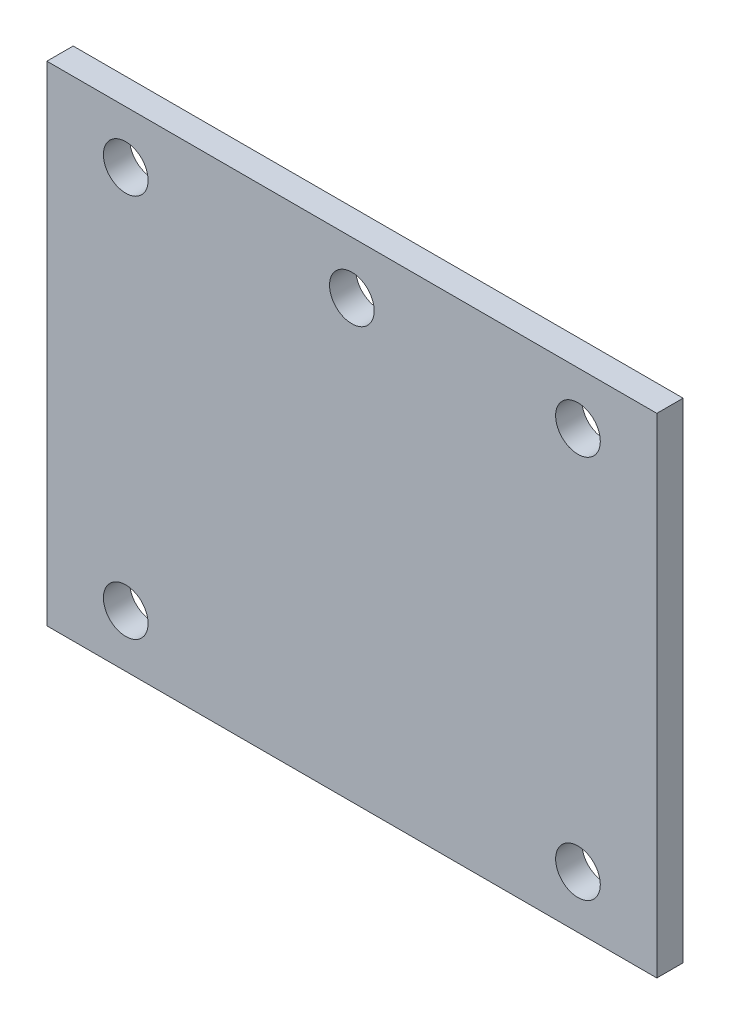
ISO-10303-21;
HEADER;
FILE_DESCRIPTION(('STEP AP214'),'2;1');
FILE_NAME('part.step','',(''),(''),'','','');
FILE_SCHEMA(('AUTOMOTIVE_DESIGN { 1 0 10303 214 1 1 1 1 }'));
ENDSEC;
DATA;
#1=APPLICATION_CONTEXT('core data for automotive mechanical design processes');
#2=APPLICATION_PROTOCOL_DEFINITION('international standard','automotive_design',2000,#1);
#3=PRODUCT_CONTEXT('',#1,'mechanical');
#4=PRODUCT('Part','Part','',(#3));
#5=PRODUCT_RELATED_PRODUCT_CATEGORY('part','',(#4));
#6=PRODUCT_DEFINITION_FORMATION('','',#4);
#7=PRODUCT_DEFINITION_CONTEXT('part definition',#1,'design');
#8=PRODUCT_DEFINITION('design','',#6,#7);
#9=PRODUCT_DEFINITION_SHAPE('','',#8);
#10=(LENGTH_UNIT() NAMED_UNIT(*) SI_UNIT(.MILLI.,.METRE.));
#11=(NAMED_UNIT(*) PLANE_ANGLE_UNIT() SI_UNIT($,.RADIAN.));
#12=(NAMED_UNIT(*) SI_UNIT($,.STERADIAN.) SOLID_ANGLE_UNIT());
#13=UNCERTAINTY_MEASURE_WITH_UNIT(LENGTH_MEASURE(1.E-05),#10,'distance_accuracy_value','');
#14=(GEOMETRIC_REPRESENTATION_CONTEXT(3) GLOBAL_UNCERTAINTY_ASSIGNED_CONTEXT((#13)) GLOBAL_UNIT_ASSIGNED_CONTEXT((#10,
#11,#12)) REPRESENTATION_CONTEXT('',''));
#15=CARTESIAN_POINT('',(0.,0.,0.));
#16=DIRECTION('',(0.,0.,1.));
#17=DIRECTION('',(1.,0.,0.));
#18=AXIS2_PLACEMENT_3D('',#15,#16,#17);
#19=CARTESIAN_POINT('',(0.,0.,5.));
#20=DIRECTION('',(0.,0.,-1.));
#21=DIRECTION('',(-1.,0.,0.));
#22=AXIS2_PLACEMENT_3D('',#19,#20,#21);
#23=PLANE('',#22);
#24=DIRECTION('',(0.,1.,0.));
#25=VECTOR('',#24,1.);
#26=CARTESIAN_POINT('',(58.,-46.5,5.));
#27=LINE('',#26,#25);
#28=CARTESIAN_POINT('',(58.,-46.5,5.));
#29=VERTEX_POINT('',#28);
#30=CARTESIAN_POINT('',(58.,46.5,5.));
#31=VERTEX_POINT('',#30);
#32=EDGE_CURVE('E94',#29,#31,#27,.T.);
#33=ORIENTED_EDGE('',*,*,#32,.T.);
#34=DIRECTION('',(-1.,0.,0.));
#35=VECTOR('',#34,1.);
#36=CARTESIAN_POINT('',(-58.,46.5,5.));
#37=LINE('',#36,#35);
#38=CARTESIAN_POINT('',(-58.,46.5,5.));
#39=VERTEX_POINT('',#38);
#40=EDGE_CURVE('E89',#31,#39,#37,.T.);
#41=ORIENTED_EDGE('',*,*,#40,.T.);
#42=DIRECTION('',(0.,-1.,0.));
#43=VECTOR('',#42,1.);
#44=CARTESIAN_POINT('',(-58.,-46.5,5.));
#45=LINE('',#44,#43);
#46=CARTESIAN_POINT('',(-58.,-46.5,5.));
#47=VERTEX_POINT('',#46);
#48=EDGE_CURVE('E92',#39,#47,#45,.T.);
#49=ORIENTED_EDGE('',*,*,#48,.T.);
#50=DIRECTION('',(1.,0.,0.));
#51=VECTOR('',#50,1.);
#52=CARTESIAN_POINT('',(-58.,-46.5,5.));
#53=LINE('',#52,#51);
#54=EDGE_CURVE('E59',#47,#29,#53,.T.);
#55=ORIENTED_EDGE('',*,*,#54,.T.);
#56=EDGE_LOOP('',(#33,#41,#49,#55));
#57=FACE_BOUND('',#56,.T.);
#58=CARTESIAN_POINT('',(-43.,36.5,5.));
#59=DIRECTION('',(0.,0.,1.));
#60=DIRECTION('',(1.,0.,0.));
#61=AXIS2_PLACEMENT_3D('',#58,#59,#60);
#62=CIRCLE('',#61,4.25000000000001);
#63=CARTESIAN_POINT('',(-38.75,36.5,5.));
#64=VERTEX_POINT('',#63);
#65=EDGE_CURVE('E116',#64,#64,#62,.T.);
#66=ORIENTED_EDGE('',*,*,#65,.F.);
#67=EDGE_LOOP('',(#66));
#68=FACE_BOUND('',#67,.T.);
#69=CARTESIAN_POINT('',(0.,36.5,5.));
#70=DIRECTION('',(0.,0.,1.));
#71=DIRECTION('',(1.,0.,0.));
#72=AXIS2_PLACEMENT_3D('',#69,#70,#71);
#73=CIRCLE('',#72,4.25000000000001);
#74=CARTESIAN_POINT('',(4.24999999999995,36.5,5.));
#75=VERTEX_POINT('',#74);
#76=EDGE_CURVE('E142',#75,#75,#73,.T.);
#77=ORIENTED_EDGE('',*,*,#76,.F.);
#78=EDGE_LOOP('',(#77));
#79=FACE_BOUND('',#78,.T.);
#80=CARTESIAN_POINT('',(42.9999999999999,36.5,5.));
#81=DIRECTION('',(0.,0.,1.));
#82=DIRECTION('',(1.,0.,0.));
#83=AXIS2_PLACEMENT_3D('',#80,#81,#82);
#84=CIRCLE('',#83,4.25000000000001);
#85=CARTESIAN_POINT('',(47.2499999999999,36.5,5.));
#86=VERTEX_POINT('',#85);
#87=EDGE_CURVE('E150',#86,#86,#84,.T.);
#88=ORIENTED_EDGE('',*,*,#87,.F.);
#89=EDGE_LOOP('',(#88));
#90=FACE_BOUND('',#89,.T.);
#91=CARTESIAN_POINT('',(43.0000000000007,-36.5,5.));
#92=DIRECTION('',(0.,0.,1.));
#93=DIRECTION('',(1.,0.,0.));
#94=AXIS2_PLACEMENT_3D('',#91,#92,#93);
#95=CIRCLE('',#94,4.25000000000001);
#96=CARTESIAN_POINT('',(47.2500000000007,-36.5,5.));
#97=VERTEX_POINT('',#96);
#98=EDGE_CURVE('E158',#97,#97,#95,.T.);
#99=ORIENTED_EDGE('',*,*,#98,.F.);
#100=EDGE_LOOP('',(#99));
#101=FACE_BOUND('',#100,.T.);
#102=CARTESIAN_POINT('',(-42.9999999999993,-36.5,5.));
#103=DIRECTION('',(0.,0.,1.));
#104=DIRECTION('',(1.,0.,0.));
#105=AXIS2_PLACEMENT_3D('',#102,#103,#104);
#106=CIRCLE('',#105,4.25000000000001);
#107=CARTESIAN_POINT('',(-38.7499999999993,-36.5,5.));
#108=VERTEX_POINT('',#107);
#109=EDGE_CURVE('E166',#108,#108,#106,.T.);
#110=ORIENTED_EDGE('',*,*,#109,.F.);
#111=EDGE_LOOP('',(#110));
#112=FACE_BOUND('',#111,.T.);
#113=ADVANCED_FACE('F41',(#57,#68,#79,#90,#101,#112),#23,.F.);
#114=CARTESIAN_POINT('',(0.,0.,0.));
#115=DIRECTION('',(0.,0.,-1.));
#116=DIRECTION('',(-1.,0.,0.));
#117=AXIS2_PLACEMENT_3D('',#114,#115,#116);
#118=PLANE('',#117);
#119=CARTESIAN_POINT('',(43.0000000000007,-36.5,0.));
#120=DIRECTION('',(0.,0.,1.));
#121=DIRECTION('',(1.,0.,0.));
#122=AXIS2_PLACEMENT_3D('',#119,#120,#121);
#123=CIRCLE('',#122,4.25000000000001);
#124=CARTESIAN_POINT('',(47.2500000000007,-36.5,0.));
#125=VERTEX_POINT('',#124);
#126=EDGE_CURVE('E162',#125,#125,#123,.T.);
#127=ORIENTED_EDGE('',*,*,#126,.T.);
#128=EDGE_LOOP('',(#127));
#129=FACE_BOUND('',#128,.T.);
#130=CARTESIAN_POINT('',(0.,36.5,0.));
#131=DIRECTION('',(0.,0.,1.));
#132=DIRECTION('',(1.,0.,0.));
#133=AXIS2_PLACEMENT_3D('',#130,#131,#132);
#134=CIRCLE('',#133,4.25000000000001);
#135=CARTESIAN_POINT('',(4.24999999999995,36.5,0.));
#136=VERTEX_POINT('',#135);
#137=EDGE_CURVE('E146',#136,#136,#134,.T.);
#138=ORIENTED_EDGE('',*,*,#137,.T.);
#139=EDGE_LOOP('',(#138));
#140=FACE_BOUND('',#139,.T.);
#141=DIRECTION('',(0.,1.,0.));
#142=VECTOR('',#141,1.);
#143=CARTESIAN_POINT('',(58.,-46.5,0.));
#144=LINE('',#143,#142);
#145=CARTESIAN_POINT('',(58.,-46.5,0.));
#146=VERTEX_POINT('',#145);
#147=CARTESIAN_POINT('',(58.,46.5,0.));
#148=VERTEX_POINT('',#147);
#149=EDGE_CURVE('E112',#146,#148,#144,.T.);
#150=ORIENTED_EDGE('',*,*,#149,.F.);
#151=DIRECTION('',(1.,0.,0.));
#152=VECTOR('',#151,1.);
#153=CARTESIAN_POINT('',(-58.,-46.5,0.));
#154=LINE('',#153,#152);
#155=CARTESIAN_POINT('',(-58.,-46.5,0.));
#156=VERTEX_POINT('',#155);
#157=EDGE_CURVE('E82',#156,#146,#154,.T.);
#158=ORIENTED_EDGE('',*,*,#157,.F.);
#159=DIRECTION('',(0.,-1.,0.));
#160=VECTOR('',#159,1.);
#161=CARTESIAN_POINT('',(-58.,-46.5,0.));
#162=LINE('',#161,#160);
#163=CARTESIAN_POINT('',(-58.,46.5,0.));
#164=VERTEX_POINT('',#163);
#165=EDGE_CURVE('E76',#164,#156,#162,.T.);
#166=ORIENTED_EDGE('',*,*,#165,.F.);
#167=DIRECTION('',(-1.,0.,0.));
#168=VECTOR('',#167,1.);
#169=CARTESIAN_POINT('',(-58.,46.5,0.));
#170=LINE('',#169,#168);
#171=EDGE_CURVE('E99',#148,#164,#170,.T.);
#172=ORIENTED_EDGE('',*,*,#171,.F.);
#173=EDGE_LOOP('',(#150,#158,#166,#172));
#174=FACE_BOUND('',#173,.T.);
#175=CARTESIAN_POINT('',(-43.,36.5,0.));
#176=DIRECTION('',(0.,0.,1.));
#177=DIRECTION('',(1.,0.,0.));
#178=AXIS2_PLACEMENT_3D('',#175,#176,#177);
#179=CIRCLE('',#178,4.25000000000001);
#180=CARTESIAN_POINT('',(-38.75,36.5,0.));
#181=VERTEX_POINT('',#180);
#182=EDGE_CURVE('E138',#181,#181,#179,.T.);
#183=ORIENTED_EDGE('',*,*,#182,.T.);
#184=EDGE_LOOP('',(#183));
#185=FACE_BOUND('',#184,.T.);
#186=CARTESIAN_POINT('',(42.9999999999999,36.5,0.));
#187=DIRECTION('',(0.,0.,1.));
#188=DIRECTION('',(1.,0.,0.));
#189=AXIS2_PLACEMENT_3D('',#186,#187,#188);
#190=CIRCLE('',#189,4.25000000000001);
#191=CARTESIAN_POINT('',(47.2499999999999,36.5,0.));
#192=VERTEX_POINT('',#191);
#193=EDGE_CURVE('E154',#192,#192,#190,.T.);
#194=ORIENTED_EDGE('',*,*,#193,.T.);
#195=EDGE_LOOP('',(#194));
#196=FACE_BOUND('',#195,.T.);
#197=CARTESIAN_POINT('',(-42.9999999999993,-36.5,0.));
#198=DIRECTION('',(0.,0.,1.));
#199=DIRECTION('',(1.,0.,0.));
#200=AXIS2_PLACEMENT_3D('',#197,#198,#199);
#201=CIRCLE('',#200,4.25000000000001);
#202=CARTESIAN_POINT('',(-38.7499999999993,-36.5,0.));
#203=VERTEX_POINT('',#202);
#204=EDGE_CURVE('E170',#203,#203,#201,.T.);
#205=ORIENTED_EDGE('',*,*,#204,.T.);
#206=EDGE_LOOP('',(#205));
#207=FACE_BOUND('',#206,.T.);
#208=ADVANCED_FACE('F131',(#129,#140,#174,#185,#196,#207),#118,.T.);
#209=CARTESIAN_POINT('',(58.,-46.5,5.));
#210=DIRECTION('',(-1.,0.,0.));
#211=DIRECTION('',(0.,0.,1.));
#212=AXIS2_PLACEMENT_3D('',#209,#210,#211);
#213=PLANE('',#212);
#214=ORIENTED_EDGE('',*,*,#149,.T.);
#215=DIRECTION('',(0.,0.,-1.));
#216=VECTOR('',#215,1.);
#217=CARTESIAN_POINT('',(58.,46.5,5.));
#218=LINE('',#217,#216);
#219=EDGE_CURVE('E11',#31,#148,#218,.T.);
#220=ORIENTED_EDGE('',*,*,#219,.F.);
#221=ORIENTED_EDGE('',*,*,#32,.F.);
#222=DIRECTION('',(0.,0.,-1.));
#223=VECTOR('',#222,1.);
#224=CARTESIAN_POINT('',(58.,-46.5,5.));
#225=LINE('',#224,#223);
#226=EDGE_CURVE('E108',#29,#146,#225,.T.);
#227=ORIENTED_EDGE('',*,*,#226,.T.);
#228=EDGE_LOOP('',(#214,#220,#221,#227));
#229=FACE_BOUND('',#228,.T.);
#230=ADVANCED_FACE('F43',(#229),#213,.F.);
#231=CARTESIAN_POINT('',(-58.,46.5,5.));
#232=DIRECTION('',(0.,-1.,0.));
#233=DIRECTION('',(0.,0.,-1.));
#234=AXIS2_PLACEMENT_3D('',#231,#232,#233);
#235=PLANE('',#234);
#236=ORIENTED_EDGE('',*,*,#171,.T.);
#237=DIRECTION('',(0.,0.,-1.));
#238=VECTOR('',#237,1.);
#239=CARTESIAN_POINT('',(-58.,46.5,5.));
#240=LINE('',#239,#238);
#241=EDGE_CURVE('E51',#39,#164,#240,.T.);
#242=ORIENTED_EDGE('',*,*,#241,.F.);
#243=ORIENTED_EDGE('',*,*,#40,.F.);
#244=ORIENTED_EDGE('',*,*,#219,.T.);
#245=EDGE_LOOP('',(#236,#242,#243,#244));
#246=FACE_BOUND('',#245,.T.);
#247=ADVANCED_FACE('F98',(#246),#235,.F.);
#248=CARTESIAN_POINT('',(-58.,-46.5,5.));
#249=DIRECTION('',(1.,0.,0.));
#250=DIRECTION('',(0.,0.,-1.));
#251=AXIS2_PLACEMENT_3D('',#248,#249,#250);
#252=PLANE('',#251);
#253=ORIENTED_EDGE('',*,*,#165,.T.);
#254=DIRECTION('',(0.,0.,-1.));
#255=VECTOR('',#254,1.);
#256=CARTESIAN_POINT('',(-58.,-46.5,5.));
#257=LINE('',#256,#255);
#258=EDGE_CURVE('E101',#47,#156,#257,.T.);
#259=ORIENTED_EDGE('',*,*,#258,.F.);
#260=ORIENTED_EDGE('',*,*,#48,.F.);
#261=ORIENTED_EDGE('',*,*,#241,.T.);
#262=EDGE_LOOP('',(#253,#259,#260,#261));
#263=FACE_BOUND('',#262,.T.);
#264=ADVANCED_FACE('F102',(#263),#252,.F.);
#265=CARTESIAN_POINT('',(-58.,-46.5,5.));
#266=DIRECTION('',(0.,1.,0.));
#267=DIRECTION('',(0.,0.,1.));
#268=AXIS2_PLACEMENT_3D('',#265,#266,#267);
#269=PLANE('',#268);
#270=ORIENTED_EDGE('',*,*,#157,.T.);
#271=ORIENTED_EDGE('',*,*,#226,.F.);
#272=ORIENTED_EDGE('',*,*,#54,.F.);
#273=ORIENTED_EDGE('',*,*,#258,.T.);
#274=EDGE_LOOP('',(#270,#271,#272,#273));
#275=FACE_BOUND('',#274,.T.);
#276=ADVANCED_FACE('F128',(#275),#269,.F.);
#277=CARTESIAN_POINT('',(-43.,36.5,5.));
#278=DIRECTION('',(0.,0.,-1.));
#279=DIRECTION('',(-1.,0.,0.));
#280=AXIS2_PLACEMENT_3D('',#277,#278,#279);
#281=CYLINDRICAL_SURFACE('',#280,4.25000000000001);
#282=ORIENTED_EDGE('',*,*,#65,.T.);
#283=EDGE_LOOP('',(#282));
#284=FACE_BOUND('',#283,.T.);
#285=ORIENTED_EDGE('',*,*,#182,.F.);
#286=EDGE_LOOP('',(#285));
#287=FACE_BOUND('',#286,.T.);
#288=ADVANCED_FACE('F191',(#284,#287),#281,.F.);
#289=CARTESIAN_POINT('',(0.,36.5,5.));
#290=DIRECTION('',(0.,0.,-1.));
#291=DIRECTION('',(-1.,0.,0.));
#292=AXIS2_PLACEMENT_3D('',#289,#290,#291);
#293=CYLINDRICAL_SURFACE('',#292,4.25000000000001);
#294=ORIENTED_EDGE('',*,*,#76,.T.);
#295=EDGE_LOOP('',(#294));
#296=FACE_BOUND('',#295,.T.);
#297=ORIENTED_EDGE('',*,*,#137,.F.);
#298=EDGE_LOOP('',(#297));
#299=FACE_BOUND('',#298,.T.);
#300=ADVANCED_FACE('F246',(#296,#299),#293,.F.);
#301=CARTESIAN_POINT('',(42.9999999999999,36.5,5.));
#302=DIRECTION('',(0.,0.,-1.));
#303=DIRECTION('',(-1.,0.,0.));
#304=AXIS2_PLACEMENT_3D('',#301,#302,#303);
#305=CYLINDRICAL_SURFACE('',#304,4.25000000000001);
#306=ORIENTED_EDGE('',*,*,#87,.T.);
#307=EDGE_LOOP('',(#306));
#308=FACE_BOUND('',#307,.T.);
#309=ORIENTED_EDGE('',*,*,#193,.F.);
#310=EDGE_LOOP('',(#309));
#311=FACE_BOUND('',#310,.T.);
#312=ADVANCED_FACE('F255',(#308,#311),#305,.F.);
#313=CARTESIAN_POINT('',(43.0000000000007,-36.5,5.));
#314=DIRECTION('',(0.,0.,-1.));
#315=DIRECTION('',(-1.,0.,0.));
#316=AXIS2_PLACEMENT_3D('',#313,#314,#315);
#317=CYLINDRICAL_SURFACE('',#316,4.25000000000001);
#318=ORIENTED_EDGE('',*,*,#98,.T.);
#319=EDGE_LOOP('',(#318));
#320=FACE_BOUND('',#319,.T.);
#321=ORIENTED_EDGE('',*,*,#126,.F.);
#322=EDGE_LOOP('',(#321));
#323=FACE_BOUND('',#322,.T.);
#324=ADVANCED_FACE('F264',(#320,#323),#317,.F.);
#325=CARTESIAN_POINT('',(-42.9999999999993,-36.5,5.));
#326=DIRECTION('',(0.,0.,-1.));
#327=DIRECTION('',(-1.,0.,0.));
#328=AXIS2_PLACEMENT_3D('',#325,#326,#327);
#329=CYLINDRICAL_SURFACE('',#328,4.25000000000001);
#330=ORIENTED_EDGE('',*,*,#109,.T.);
#331=EDGE_LOOP('',(#330));
#332=FACE_BOUND('',#331,.T.);
#333=ORIENTED_EDGE('',*,*,#204,.F.);
#334=EDGE_LOOP('',(#333));
#335=FACE_BOUND('',#334,.T.);
#336=ADVANCED_FACE('F180',(#332,#335),#329,.F.);
#337=CLOSED_SHELL('',(#113,#208,#230,#247,#264,#276,#288,#300,#312,#324,#336));
#338=MANIFOLD_SOLID_BREP('B2',#337);
#339=ADVANCED_BREP_SHAPE_REPRESENTATION('',(#18,#338),#14);
#340=SHAPE_DEFINITION_REPRESENTATION(#9,#339);
ENDSEC;
END-ISO-10303-21;
